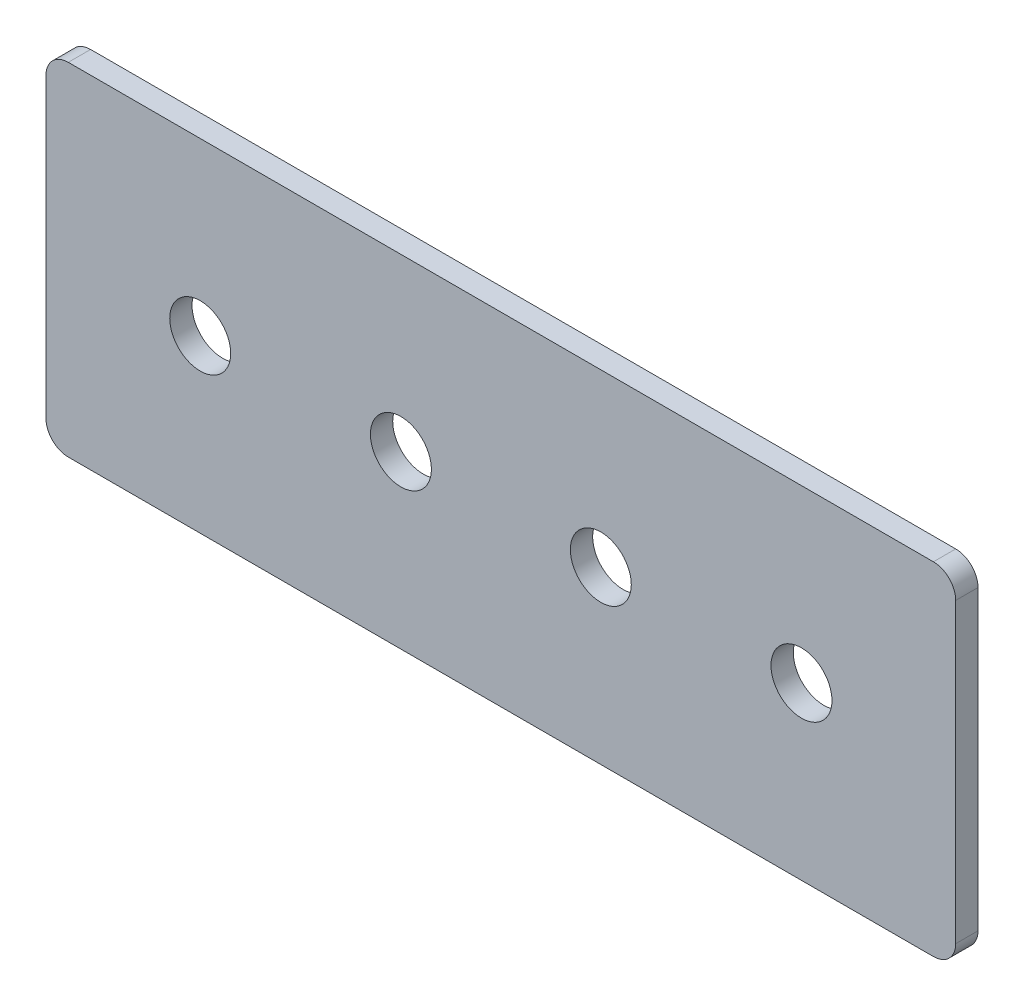
ISO-10303-21;
HEADER;
FILE_DESCRIPTION(('STEP AP214'),'2;1');
FILE_NAME('part.step','',(''),(''),'','','');
FILE_SCHEMA(('AUTOMOTIVE_DESIGN { 1 0 10303 214 1 1 1 1 }'));
ENDSEC;
DATA;
#1=APPLICATION_CONTEXT('core data for automotive mechanical design processes');
#2=APPLICATION_PROTOCOL_DEFINITION('international standard','automotive_design',2000,#1);
#3=PRODUCT_CONTEXT('',#1,'mechanical');
#4=PRODUCT('Part','Part','',(#3));
#5=PRODUCT_RELATED_PRODUCT_CATEGORY('part','',(#4));
#6=PRODUCT_DEFINITION_FORMATION('','',#4);
#7=PRODUCT_DEFINITION_CONTEXT('part definition',#1,'design');
#8=PRODUCT_DEFINITION('design','',#6,#7);
#9=PRODUCT_DEFINITION_SHAPE('','',#8);
#10=(LENGTH_UNIT() NAMED_UNIT(*) SI_UNIT(.MILLI.,.METRE.));
#11=(NAMED_UNIT(*) PLANE_ANGLE_UNIT() SI_UNIT($,.RADIAN.));
#12=(NAMED_UNIT(*) SI_UNIT($,.STERADIAN.) SOLID_ANGLE_UNIT());
#13=UNCERTAINTY_MEASURE_WITH_UNIT(LENGTH_MEASURE(1.E-05),#10,'distance_accuracy_value','');
#14=(GEOMETRIC_REPRESENTATION_CONTEXT(3) GLOBAL_UNCERTAINTY_ASSIGNED_CONTEXT((#13)) GLOBAL_UNIT_ASSIGNED_CONTEXT((#10,
#11,#12)) REPRESENTATION_CONTEXT('',''));
#15=CARTESIAN_POINT('',(0.,0.,0.));
#16=DIRECTION('',(0.,0.,1.));
#17=DIRECTION('',(1.,0.,0.));
#18=AXIS2_PLACEMENT_3D('',#15,#16,#17);
#19=CARTESIAN_POINT('',(-61.2,23.,4.));
#20=DIRECTION('',(0.,-1.,0.));
#21=DIRECTION('',(-1.,0.,0.));
#22=AXIS2_PLACEMENT_3D('',#19,#20,#21);
#23=PLANE('',#22);
#24=DIRECTION('',(0.,0.,1.));
#25=VECTOR('',#24,1.);
#26=CARTESIAN_POINT('',(58.2,23.,4.));
#27=LINE('',#26,#25);
#28=CARTESIAN_POINT('',(58.2,23.,1.));
#29=VERTEX_POINT('',#28);
#30=CARTESIAN_POINT('',(58.2,23.,4.));
#31=VERTEX_POINT('',#30);
#32=EDGE_CURVE('E11',#29,#31,#27,.T.);
#33=ORIENTED_EDGE('',*,*,#32,.F.);
#34=DIRECTION('',(-1.,0.,0.));
#35=VECTOR('',#34,1.);
#36=CARTESIAN_POINT('',(0.,23.,1.));
#37=LINE('',#36,#35);
#38=CARTESIAN_POINT('',(-58.2,23.,1.));
#39=VERTEX_POINT('',#38);
#40=EDGE_CURVE('E109',#29,#39,#37,.T.);
#41=ORIENTED_EDGE('',*,*,#40,.T.);
#42=DIRECTION('',(0.,0.,1.));
#43=VECTOR('',#42,1.);
#44=CARTESIAN_POINT('',(-58.2,23.,4.));
#45=LINE('',#44,#43);
#46=CARTESIAN_POINT('',(-58.2,23.,4.));
#47=VERTEX_POINT('',#46);
#48=EDGE_CURVE('E51',#39,#47,#45,.T.);
#49=ORIENTED_EDGE('',*,*,#48,.T.);
#50=DIRECTION('',(-1.,0.,0.));
#51=VECTOR('',#50,1.);
#52=CARTESIAN_POINT('',(-61.2,23.,4.));
#53=LINE('',#52,#51);
#54=EDGE_CURVE('E168',#31,#47,#53,.T.);
#55=ORIENTED_EDGE('',*,*,#54,.F.);
#56=EDGE_LOOP('',(#33,#41,#49,#55));
#57=FACE_BOUND('',#56,.T.);
#58=ADVANCED_FACE('F40',(#57),#23,.F.);
#59=CARTESIAN_POINT('',(-58.2,20.,4.));
#60=DIRECTION('',(0.,0.,-1.));
#61=DIRECTION('',(-1.,0.,0.));
#62=AXIS2_PLACEMENT_3D('',#59,#60,#61);
#63=CYLINDRICAL_SURFACE('',#62,3.);
#64=ORIENTED_EDGE('',*,*,#48,.F.);
#65=CARTESIAN_POINT('',(-58.2,20.,1.));
#66=DIRECTION('',(0.,0.,-1.));
#67=DIRECTION('',(-1.,0.,0.));
#68=AXIS2_PLACEMENT_3D('',#65,#66,#67);
#69=CIRCLE('',#68,3.);
#70=CARTESIAN_POINT('',(-61.2,20.,1.));
#71=VERTEX_POINT('',#70);
#72=EDGE_CURVE('E139',#39,#71,#69,.F.);
#73=ORIENTED_EDGE('',*,*,#72,.T.);
#74=DIRECTION('',(0.,0.,1.));
#75=VECTOR('',#74,1.);
#76=CARTESIAN_POINT('',(-61.2,20.,4.));
#77=LINE('',#76,#75);
#78=CARTESIAN_POINT('',(-61.2,20.,4.));
#79=VERTEX_POINT('',#78);
#80=EDGE_CURVE('E158',#71,#79,#77,.T.);
#81=ORIENTED_EDGE('',*,*,#80,.T.);
#82=CARTESIAN_POINT('',(-58.2,20.,4.));
#83=DIRECTION('',(0.,0.,-1.));
#84=DIRECTION('',(-1.,0.,0.));
#85=AXIS2_PLACEMENT_3D('',#82,#83,#84);
#86=CIRCLE('',#85,3.);
#87=EDGE_CURVE('E177',#47,#79,#86,.F.);
#88=ORIENTED_EDGE('',*,*,#87,.F.);
#89=EDGE_LOOP('',(#64,#73,#81,#88));
#90=FACE_BOUND('',#89,.T.);
#91=ADVANCED_FACE('F181',(#90),#63,.T.);
#92=CARTESIAN_POINT('',(-61.2,-23.,4.));
#93=DIRECTION('',(1.,0.,0.));
#94=DIRECTION('',(0.,-1.,0.));
#95=AXIS2_PLACEMENT_3D('',#92,#93,#94);
#96=PLANE('',#95);
#97=ORIENTED_EDGE('',*,*,#80,.F.);
#98=DIRECTION('',(0.,1.,0.));
#99=VECTOR('',#98,1.);
#100=CARTESIAN_POINT('',(-61.2,0.,1.));
#101=LINE('',#100,#99);
#102=CARTESIAN_POINT('',(-61.2,-20.,1.));
#103=VERTEX_POINT('',#102);
#104=EDGE_CURVE('E135',#71,#103,#101,.F.);
#105=ORIENTED_EDGE('',*,*,#104,.T.);
#106=DIRECTION('',(0.,0.,1.));
#107=VECTOR('',#106,1.);
#108=CARTESIAN_POINT('',(-61.2,-20.,4.));
#109=LINE('',#108,#107);
#110=CARTESIAN_POINT('',(-61.2,-20.,4.));
#111=VERTEX_POINT('',#110);
#112=EDGE_CURVE('E154',#103,#111,#109,.T.);
#113=ORIENTED_EDGE('',*,*,#112,.T.);
#114=DIRECTION('',(0.,-1.,0.));
#115=VECTOR('',#114,1.);
#116=CARTESIAN_POINT('',(-61.2,-23.,4.));
#117=LINE('',#116,#115);
#118=EDGE_CURVE('E183',#79,#111,#117,.T.);
#119=ORIENTED_EDGE('',*,*,#118,.F.);
#120=EDGE_LOOP('',(#97,#105,#113,#119));
#121=FACE_BOUND('',#120,.T.);
#122=ADVANCED_FACE('F238',(#121),#96,.F.);
#123=CARTESIAN_POINT('',(-58.2,-20.,4.));
#124=DIRECTION('',(0.,0.,-1.));
#125=DIRECTION('',(-1.,0.,0.));
#126=AXIS2_PLACEMENT_3D('',#123,#124,#125);
#127=CYLINDRICAL_SURFACE('',#126,3.);
#128=ORIENTED_EDGE('',*,*,#112,.F.);
#129=CARTESIAN_POINT('',(-58.2,-20.,1.));
#130=DIRECTION('',(0.,0.,-1.));
#131=DIRECTION('',(-1.,0.,0.));
#132=AXIS2_PLACEMENT_3D('',#129,#130,#131);
#133=CIRCLE('',#132,3.);
#134=CARTESIAN_POINT('',(-58.2,-23.,1.));
#135=VERTEX_POINT('',#134);
#136=EDGE_CURVE('E131',#103,#135,#133,.F.);
#137=ORIENTED_EDGE('',*,*,#136,.T.);
#138=DIRECTION('',(0.,0.,1.));
#139=VECTOR('',#138,1.);
#140=CARTESIAN_POINT('',(-58.2,-23.,4.));
#141=LINE('',#140,#139);
#142=CARTESIAN_POINT('',(-58.2,-23.,4.));
#143=VERTEX_POINT('',#142);
#144=EDGE_CURVE('E150',#135,#143,#141,.T.);
#145=ORIENTED_EDGE('',*,*,#144,.T.);
#146=CARTESIAN_POINT('',(-58.2,-20.,4.));
#147=DIRECTION('',(0.,0.,-1.));
#148=DIRECTION('',(-1.,0.,0.));
#149=AXIS2_PLACEMENT_3D('',#146,#147,#148);
#150=CIRCLE('',#149,3.);
#151=EDGE_CURVE('E187',#111,#143,#150,.F.);
#152=ORIENTED_EDGE('',*,*,#151,.F.);
#153=EDGE_LOOP('',(#128,#137,#145,#152));
#154=FACE_BOUND('',#153,.T.);
#155=ADVANCED_FACE('F243',(#154),#127,.T.);
#156=CARTESIAN_POINT('',(-61.2,-23.,4.));
#157=DIRECTION('',(0.,1.,0.));
#158=DIRECTION('',(1.,0.,0.));
#159=AXIS2_PLACEMENT_3D('',#156,#157,#158);
#160=PLANE('',#159);
#161=ORIENTED_EDGE('',*,*,#144,.F.);
#162=DIRECTION('',(-1.,0.,0.));
#163=VECTOR('',#162,1.);
#164=CARTESIAN_POINT('',(0.,-23.,1.));
#165=LINE('',#164,#163);
#166=CARTESIAN_POINT('',(58.2,-23.,1.));
#167=VERTEX_POINT('',#166);
#168=EDGE_CURVE('E127',#135,#167,#165,.F.);
#169=ORIENTED_EDGE('',*,*,#168,.T.);
#170=DIRECTION('',(0.,0.,1.));
#171=VECTOR('',#170,1.);
#172=CARTESIAN_POINT('',(58.2,-23.,4.));
#173=LINE('',#172,#171);
#174=CARTESIAN_POINT('',(58.2,-23.,4.));
#175=VERTEX_POINT('',#174);
#176=EDGE_CURVE('E147',#167,#175,#173,.T.);
#177=ORIENTED_EDGE('',*,*,#176,.T.);
#178=DIRECTION('',(1.,0.,0.));
#179=VECTOR('',#178,1.);
#180=CARTESIAN_POINT('',(-61.2,-23.,4.));
#181=LINE('',#180,#179);
#182=EDGE_CURVE('E194',#143,#175,#181,.T.);
#183=ORIENTED_EDGE('',*,*,#182,.F.);
#184=EDGE_LOOP('',(#161,#169,#177,#183));
#185=FACE_BOUND('',#184,.T.);
#186=ADVANCED_FACE('F247',(#185),#160,.F.);
#187=CARTESIAN_POINT('',(58.2,-20.,4.));
#188=DIRECTION('',(0.,0.,-1.));
#189=DIRECTION('',(-1.,0.,0.));
#190=AXIS2_PLACEMENT_3D('',#187,#188,#189);
#191=CYLINDRICAL_SURFACE('',#190,3.);
#192=ORIENTED_EDGE('',*,*,#176,.F.);
#193=CARTESIAN_POINT('',(58.2,-20.,1.));
#194=DIRECTION('',(0.,0.,-1.));
#195=DIRECTION('',(-1.,0.,0.));
#196=AXIS2_PLACEMENT_3D('',#193,#194,#195);
#197=CIRCLE('',#196,3.);
#198=CARTESIAN_POINT('',(61.2,-20.,1.));
#199=VERTEX_POINT('',#198);
#200=EDGE_CURVE('E123',#167,#199,#197,.F.);
#201=ORIENTED_EDGE('',*,*,#200,.T.);
#202=DIRECTION('',(0.,0.,1.));
#203=VECTOR('',#202,1.);
#204=CARTESIAN_POINT('',(61.2,-20.,4.));
#205=LINE('',#204,#203);
#206=CARTESIAN_POINT('',(61.2,-20.,4.));
#207=VERTEX_POINT('',#206);
#208=EDGE_CURVE('E59',#199,#207,#205,.T.);
#209=ORIENTED_EDGE('',*,*,#208,.T.);
#210=CARTESIAN_POINT('',(58.2,-20.,4.));
#211=DIRECTION('',(0.,0.,-1.));
#212=DIRECTION('',(-1.,0.,0.));
#213=AXIS2_PLACEMENT_3D('',#210,#211,#212);
#214=CIRCLE('',#213,3.);
#215=EDGE_CURVE('E102',#175,#207,#214,.F.);
#216=ORIENTED_EDGE('',*,*,#215,.F.);
#217=EDGE_LOOP('',(#192,#201,#209,#216));
#218=FACE_BOUND('',#217,.T.);
#219=ADVANCED_FACE('F251',(#218),#191,.T.);
#220=CARTESIAN_POINT('',(61.2,-23.,4.));
#221=DIRECTION('',(-1.,0.,0.));
#222=DIRECTION('',(0.,1.,0.));
#223=AXIS2_PLACEMENT_3D('',#220,#221,#222);
#224=PLANE('',#223);
#225=ORIENTED_EDGE('',*,*,#208,.F.);
#226=DIRECTION('',(0.,1.,0.));
#227=VECTOR('',#226,1.);
#228=CARTESIAN_POINT('',(61.2,0.,1.));
#229=LINE('',#228,#227);
#230=CARTESIAN_POINT('',(61.2,20.,1.));
#231=VERTEX_POINT('',#230);
#232=EDGE_CURVE('E107',#199,#231,#229,.T.);
#233=ORIENTED_EDGE('',*,*,#232,.T.);
#234=DIRECTION('',(0.,0.,1.));
#235=VECTOR('',#234,1.);
#236=CARTESIAN_POINT('',(61.2,20.,4.));
#237=LINE('',#236,#235);
#238=CARTESIAN_POINT('',(61.2,20.,4.));
#239=VERTEX_POINT('',#238);
#240=EDGE_CURVE('E44',#231,#239,#237,.T.);
#241=ORIENTED_EDGE('',*,*,#240,.T.);
#242=DIRECTION('',(0.,1.,0.));
#243=VECTOR('',#242,1.);
#244=CARTESIAN_POINT('',(61.2,-23.,4.));
#245=LINE('',#244,#243);
#246=EDGE_CURVE('E286',#207,#239,#245,.T.);
#247=ORIENTED_EDGE('',*,*,#246,.F.);
#248=EDGE_LOOP('',(#225,#233,#241,#247));
#249=FACE_BOUND('',#248,.T.);
#250=ADVANCED_FACE('F112',(#249),#224,.F.);
#251=CARTESIAN_POINT('',(-40.45,0.,4.));
#252=DIRECTION('',(0.,0.,-1.));
#253=DIRECTION('',(-1.,0.,0.));
#254=AXIS2_PLACEMENT_3D('',#251,#252,#253);
#255=CYLINDRICAL_SURFACE('',#254,4.1);
#256=CARTESIAN_POINT('',(-40.45,0.,4.));
#257=DIRECTION('',(0.,0.,-1.));
#258=DIRECTION('',(-1.,0.,0.));
#259=AXIS2_PLACEMENT_3D('',#256,#257,#258);
#260=CIRCLE('',#259,4.1);
#261=CARTESIAN_POINT('',(-44.55,0.,4.));
#262=VERTEX_POINT('',#261);
#263=EDGE_CURVE('E126',#262,#262,#260,.T.);
#264=ORIENTED_EDGE('',*,*,#263,.F.);
#265=EDGE_LOOP('',(#264));
#266=FACE_BOUND('',#265,.T.);
#267=CARTESIAN_POINT('',(-40.45,0.,1.));
#268=DIRECTION('',(0.,0.,-1.));
#269=DIRECTION('',(-1.,0.,0.));
#270=AXIS2_PLACEMENT_3D('',#267,#268,#269);
#271=CIRCLE('',#270,4.1);
#272=CARTESIAN_POINT('',(-44.55,0.,1.));
#273=VERTEX_POINT('',#272);
#274=EDGE_CURVE('E201',#273,#273,#271,.T.);
#275=ORIENTED_EDGE('',*,*,#274,.T.);
#276=EDGE_LOOP('',(#275));
#277=FACE_BOUND('',#276,.T.);
#278=ADVANCED_FACE('F255',(#266,#277),#255,.F.);
#279=CARTESIAN_POINT('',(13.45,0.,4.));
#280=DIRECTION('',(0.,0.,-1.));
#281=DIRECTION('',(-1.,0.,0.));
#282=AXIS2_PLACEMENT_3D('',#279,#280,#281);
#283=CYLINDRICAL_SURFACE('',#282,4.1);
#284=CARTESIAN_POINT('',(13.45,0.,4.));
#285=DIRECTION('',(0.,0.,-1.));
#286=DIRECTION('',(1.,0.,0.));
#287=AXIS2_PLACEMENT_3D('',#284,#285,#286);
#288=CIRCLE('',#287,4.1);
#289=CARTESIAN_POINT('',(17.55,0.,4.));
#290=VERTEX_POINT('',#289);
#291=EDGE_CURVE('E278',#290,#290,#288,.T.);
#292=ORIENTED_EDGE('',*,*,#291,.F.);
#293=EDGE_LOOP('',(#292));
#294=FACE_BOUND('',#293,.T.);
#295=CARTESIAN_POINT('',(13.45,0.,1.));
#296=DIRECTION('',(0.,0.,-1.));
#297=DIRECTION('',(-1.,0.,0.));
#298=AXIS2_PLACEMENT_3D('',#295,#296,#297);
#299=CIRCLE('',#298,4.1);
#300=CARTESIAN_POINT('',(9.35000000000002,0.,1.));
#301=VERTEX_POINT('',#300);
#302=EDGE_CURVE('E205',#301,#301,#299,.T.);
#303=ORIENTED_EDGE('',*,*,#302,.T.);
#304=EDGE_LOOP('',(#303));
#305=FACE_BOUND('',#304,.T.);
#306=ADVANCED_FACE('F229',(#294,#305),#283,.F.);
#307=CARTESIAN_POINT('',(40.45,0.,4.));
#308=DIRECTION('',(0.,0.,-1.));
#309=DIRECTION('',(-1.,0.,0.));
#310=AXIS2_PLACEMENT_3D('',#307,#308,#309);
#311=CYLINDRICAL_SURFACE('',#310,4.1);
#312=CARTESIAN_POINT('',(40.45,0.,4.));
#313=DIRECTION('',(0.,0.,-1.));
#314=DIRECTION('',(1.,0.,0.));
#315=AXIS2_PLACEMENT_3D('',#312,#313,#314);
#316=CIRCLE('',#315,4.1);
#317=CARTESIAN_POINT('',(44.55,0.,4.));
#318=VERTEX_POINT('',#317);
#319=EDGE_CURVE('E282',#318,#318,#316,.T.);
#320=ORIENTED_EDGE('',*,*,#319,.F.);
#321=EDGE_LOOP('',(#320));
#322=FACE_BOUND('',#321,.T.);
#323=CARTESIAN_POINT('',(40.45,0.,1.));
#324=DIRECTION('',(0.,0.,-1.));
#325=DIRECTION('',(-1.,0.,0.));
#326=AXIS2_PLACEMENT_3D('',#323,#324,#325);
#327=CIRCLE('',#326,4.1);
#328=CARTESIAN_POINT('',(36.35,0.,1.));
#329=VERTEX_POINT('',#328);
#330=EDGE_CURVE('E119',#329,#329,#327,.T.);
#331=ORIENTED_EDGE('',*,*,#330,.T.);
#332=EDGE_LOOP('',(#331));
#333=FACE_BOUND('',#332,.T.);
#334=ADVANCED_FACE('F213',(#322,#333),#311,.F.);
#335=CARTESIAN_POINT('',(-13.45,0.,4.));
#336=DIRECTION('',(0.,0.,-1.));
#337=DIRECTION('',(-1.,0.,0.));
#338=AXIS2_PLACEMENT_3D('',#335,#336,#337);
#339=CYLINDRICAL_SURFACE('',#338,4.1);
#340=CARTESIAN_POINT('',(-13.45,0.,4.));
#341=DIRECTION('',(0.,0.,-1.));
#342=DIRECTION('',(-1.,0.,0.));
#343=AXIS2_PLACEMENT_3D('',#340,#341,#342);
#344=CIRCLE('',#343,4.1);
#345=CARTESIAN_POINT('',(-17.55,0.,4.));
#346=VERTEX_POINT('',#345);
#347=EDGE_CURVE('E284',#346,#346,#344,.T.);
#348=ORIENTED_EDGE('',*,*,#347,.F.);
#349=EDGE_LOOP('',(#348));
#350=FACE_BOUND('',#349,.T.);
#351=CARTESIAN_POINT('',(-13.45,0.,1.));
#352=DIRECTION('',(0.,0.,-1.));
#353=DIRECTION('',(-1.,0.,0.));
#354=AXIS2_PLACEMENT_3D('',#351,#352,#353);
#355=CIRCLE('',#354,4.1);
#356=CARTESIAN_POINT('',(-17.55,0.,1.));
#357=VERTEX_POINT('',#356);
#358=EDGE_CURVE('E114',#357,#357,#355,.T.);
#359=ORIENTED_EDGE('',*,*,#358,.T.);
#360=EDGE_LOOP('',(#359));
#361=FACE_BOUND('',#360,.T.);
#362=ADVANCED_FACE('F221',(#350,#361),#339,.F.);
#363=CARTESIAN_POINT('',(58.2,20.,4.));
#364=DIRECTION('',(0.,0.,-1.));
#365=DIRECTION('',(-1.,0.,0.));
#366=AXIS2_PLACEMENT_3D('',#363,#364,#365);
#367=CYLINDRICAL_SURFACE('',#366,3.);
#368=CARTESIAN_POINT('',(58.2,20.,1.));
#369=DIRECTION('',(0.,0.,-1.));
#370=DIRECTION('',(-1.,0.,0.));
#371=AXIS2_PLACEMENT_3D('',#368,#369,#370);
#372=CIRCLE('',#371,3.);
#373=EDGE_CURVE('E95',#231,#29,#372,.F.);
#374=ORIENTED_EDGE('',*,*,#373,.T.);
#375=ORIENTED_EDGE('',*,*,#32,.T.);
#376=CARTESIAN_POINT('',(58.2,20.,4.));
#377=DIRECTION('',(0.,0.,-1.));
#378=DIRECTION('',(-1.,0.,0.));
#379=AXIS2_PLACEMENT_3D('',#376,#377,#378);
#380=CIRCLE('',#379,3.);
#381=EDGE_CURVE('E97',#239,#31,#380,.F.);
#382=ORIENTED_EDGE('',*,*,#381,.F.);
#383=ORIENTED_EDGE('',*,*,#240,.F.);
#384=EDGE_LOOP('',(#374,#375,#382,#383));
#385=FACE_BOUND('',#384,.T.);
#386=ADVANCED_FACE('F42',(#385),#367,.T.);
#387=CARTESIAN_POINT('',(0.,0.,4.));
#388=DIRECTION('',(0.,0.,-1.));
#389=DIRECTION('',(-1.,0.,0.));
#390=AXIS2_PLACEMENT_3D('',#387,#388,#389);
#391=PLANE('',#390);
#392=ORIENTED_EDGE('',*,*,#263,.T.);
#393=EDGE_LOOP('',(#392));
#394=FACE_BOUND('',#393,.T.);
#395=ORIENTED_EDGE('',*,*,#291,.T.);
#396=EDGE_LOOP('',(#395));
#397=FACE_BOUND('',#396,.T.);
#398=ORIENTED_EDGE('',*,*,#319,.T.);
#399=EDGE_LOOP('',(#398));
#400=FACE_BOUND('',#399,.T.);
#401=ORIENTED_EDGE('',*,*,#347,.T.);
#402=EDGE_LOOP('',(#401));
#403=FACE_BOUND('',#402,.T.);
#404=ORIENTED_EDGE('',*,*,#246,.T.);
#405=ORIENTED_EDGE('',*,*,#381,.T.);
#406=ORIENTED_EDGE('',*,*,#54,.T.);
#407=ORIENTED_EDGE('',*,*,#87,.T.);
#408=ORIENTED_EDGE('',*,*,#118,.T.);
#409=ORIENTED_EDGE('',*,*,#151,.T.);
#410=ORIENTED_EDGE('',*,*,#182,.T.);
#411=ORIENTED_EDGE('',*,*,#215,.T.);
#412=EDGE_LOOP('',(#404,#405,#406,#407,#408,#409,#410,#411));
#413=FACE_BOUND('',#412,.T.);
#414=ADVANCED_FACE('F175',(#394,#397,#400,#403,#413),#391,.F.);
#415=CARTESIAN_POINT('',(0.,0.,1.));
#416=DIRECTION('',(0.,0.,-1.));
#417=DIRECTION('',(-1.,0.,0.));
#418=AXIS2_PLACEMENT_3D('',#415,#416,#417);
#419=PLANE('',#418);
#420=ORIENTED_EDGE('',*,*,#274,.F.);
#421=EDGE_LOOP('',(#420));
#422=FACE_BOUND('',#421,.T.);
#423=ORIENTED_EDGE('',*,*,#302,.F.);
#424=EDGE_LOOP('',(#423));
#425=FACE_BOUND('',#424,.T.);
#426=ORIENTED_EDGE('',*,*,#330,.F.);
#427=EDGE_LOOP('',(#426));
#428=FACE_BOUND('',#427,.T.);
#429=ORIENTED_EDGE('',*,*,#358,.F.);
#430=EDGE_LOOP('',(#429));
#431=FACE_BOUND('',#430,.T.);
#432=ORIENTED_EDGE('',*,*,#232,.F.);
#433=ORIENTED_EDGE('',*,*,#200,.F.);
#434=ORIENTED_EDGE('',*,*,#168,.F.);
#435=ORIENTED_EDGE('',*,*,#136,.F.);
#436=ORIENTED_EDGE('',*,*,#104,.F.);
#437=ORIENTED_EDGE('',*,*,#72,.F.);
#438=ORIENTED_EDGE('',*,*,#40,.F.);
#439=ORIENTED_EDGE('',*,*,#373,.F.);
#440=EDGE_LOOP('',(#432,#433,#434,#435,#436,#437,#438,#439));
#441=FACE_BOUND('',#440,.T.);
#442=ADVANCED_FACE('F105',(#422,#425,#428,#431,#441),#419,.T.);
#443=CLOSED_SHELL('',(#58,#91,#122,#155,#186,#219,#250,#278,#306,#334,#362,#386,#414,#442));
#444=MANIFOLD_SOLID_BREP('B2',#443);
#445=ADVANCED_BREP_SHAPE_REPRESENTATION('',(#18,#444),#14);
#446=SHAPE_DEFINITION_REPRESENTATION(#9,#445);
ENDSEC;
END-ISO-10303-21;
